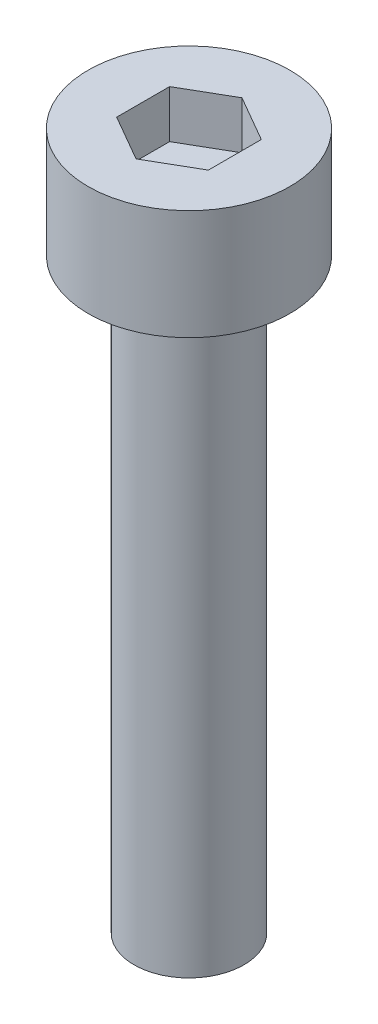
ISO-10303-21;
HEADER;
FILE_DESCRIPTION(('STEP AP214'),'2;1');
FILE_NAME('part.step','',(''),(''),'','','');
FILE_SCHEMA(('AUTOMOTIVE_DESIGN { 1 0 10303 214 1 1 1 1 }'));
ENDSEC;
DATA;
#1=APPLICATION_CONTEXT('core data for automotive mechanical design processes');
#2=APPLICATION_PROTOCOL_DEFINITION('international standard','automotive_design',2000,#1);
#3=PRODUCT_CONTEXT('',#1,'mechanical');
#4=PRODUCT('Part','Part','',(#3));
#5=PRODUCT_RELATED_PRODUCT_CATEGORY('part','',(#4));
#6=PRODUCT_DEFINITION_FORMATION('','',#4);
#7=PRODUCT_DEFINITION_CONTEXT('part definition',#1,'design');
#8=PRODUCT_DEFINITION('design','',#6,#7);
#9=PRODUCT_DEFINITION_SHAPE('','',#8);
#10=(LENGTH_UNIT() NAMED_UNIT(*) SI_UNIT(.MILLI.,.METRE.));
#11=(NAMED_UNIT(*) PLANE_ANGLE_UNIT() SI_UNIT($,.RADIAN.));
#12=(NAMED_UNIT(*) SI_UNIT($,.STERADIAN.) SOLID_ANGLE_UNIT());
#13=UNCERTAINTY_MEASURE_WITH_UNIT(LENGTH_MEASURE(1.E-05),#10,'distance_accuracy_value','');
#14=(GEOMETRIC_REPRESENTATION_CONTEXT(3) GLOBAL_UNCERTAINTY_ASSIGNED_CONTEXT((#13)) GLOBAL_UNIT_ASSIGNED_CONTEXT((#10,
#11,#12)) REPRESENTATION_CONTEXT('',''));
#15=CARTESIAN_POINT('',(0.,0.,0.));
#16=DIRECTION('',(0.,0.,1.));
#17=DIRECTION('',(1.,0.,0.));
#18=AXIS2_PLACEMENT_3D('',#15,#16,#17);
#19=CARTESIAN_POINT('',(0.,3.,0.));
#20=DIRECTION('',(0.,-1.,0.));
#21=DIRECTION('',(0.,0.,-1.));
#22=AXIS2_PLACEMENT_3D('',#19,#20,#21);
#23=CYLINDRICAL_SURFACE('',#22,2.75);
#24=CARTESIAN_POINT('',(0.,3.,0.));
#25=DIRECTION('',(0.,1.,0.));
#26=DIRECTION('',(0.,0.,1.));
#27=AXIS2_PLACEMENT_3D('',#24,#25,#26);
#28=CIRCLE('',#27,2.75);
#29=CARTESIAN_POINT('',(0.,3.,2.75));
#30=VERTEX_POINT('',#29);
#31=EDGE_CURVE('E48',#30,#30,#28,.T.);
#32=ORIENTED_EDGE('',*,*,#31,.F.);
#33=EDGE_LOOP('',(#32));
#34=FACE_BOUND('',#33,.T.);
#35=CARTESIAN_POINT('',(0.,0.,0.));
#36=DIRECTION('',(0.,1.,0.));
#37=DIRECTION('',(0.,0.,1.));
#38=AXIS2_PLACEMENT_3D('',#35,#36,#37);
#39=CIRCLE('',#38,2.75);
#40=CARTESIAN_POINT('',(0.,0.,2.75));
#41=VERTEX_POINT('',#40);
#42=EDGE_CURVE('E42',#41,#41,#39,.T.);
#43=ORIENTED_EDGE('',*,*,#42,.T.);
#44=EDGE_LOOP('',(#43));
#45=FACE_BOUND('',#44,.T.);
#46=ADVANCED_FACE('F39',(#34,#45),#23,.T.);
#47=CARTESIAN_POINT('',(0.,3.,0.));
#48=DIRECTION('',(0.,1.,0.));
#49=DIRECTION('',(0.,0.,1.));
#50=AXIS2_PLACEMENT_3D('',#47,#48,#49);
#51=PLANE('',#50);
#52=DIRECTION('',(-0.866025403784439,0.,-0.5));
#53=VECTOR('',#52,1.);
#54=CARTESIAN_POINT('',(1.25,3.,-0.721687836487033));
#55=LINE('',#54,#53);
#56=CARTESIAN_POINT('',(1.25,3.,-0.721687836487033));
#57=VERTEX_POINT('',#56);
#58=CARTESIAN_POINT('',(0.,3.,-1.44337567297407));
#59=VERTEX_POINT('',#58);
#60=EDGE_CURVE('E56',#57,#59,#55,.T.);
#61=ORIENTED_EDGE('',*,*,#60,.F.);
#62=DIRECTION('',(0.,0.,-1.));
#63=VECTOR('',#62,1.);
#64=CARTESIAN_POINT('',(1.25,3.,0.721687836487033));
#65=LINE('',#64,#63);
#66=CARTESIAN_POINT('',(1.25,3.,0.721687836487033));
#67=VERTEX_POINT('',#66);
#68=EDGE_CURVE('E150',#67,#57,#65,.T.);
#69=ORIENTED_EDGE('',*,*,#68,.F.);
#70=DIRECTION('',(0.866025403784439,0.,-0.5));
#71=VECTOR('',#70,1.);
#72=CARTESIAN_POINT('',(0.,3.,1.44337567297406));
#73=LINE('',#72,#71);
#74=CARTESIAN_POINT('',(0.,3.,1.44337567297406));
#75=VERTEX_POINT('',#74);
#76=EDGE_CURVE('E147',#75,#67,#73,.T.);
#77=ORIENTED_EDGE('',*,*,#76,.F.);
#78=DIRECTION('',(0.866025403784439,0.,0.5));
#79=VECTOR('',#78,1.);
#80=CARTESIAN_POINT('',(-1.25,3.,0.721687836487032));
#81=LINE('',#80,#79);
#82=CARTESIAN_POINT('',(-1.25,3.,0.721687836487032));
#83=VERTEX_POINT('',#82);
#84=EDGE_CURVE('E104',#83,#75,#81,.T.);
#85=ORIENTED_EDGE('',*,*,#84,.F.);
#86=DIRECTION('',(0.,0.,1.));
#87=VECTOR('',#86,1.);
#88=CARTESIAN_POINT('',(-1.25,3.,-0.721687836487033));
#89=LINE('',#88,#87);
#90=CARTESIAN_POINT('',(-1.25,3.,-0.721687836487033));
#91=VERTEX_POINT('',#90);
#92=EDGE_CURVE('E141',#91,#83,#89,.T.);
#93=ORIENTED_EDGE('',*,*,#92,.F.);
#94=DIRECTION('',(-0.866025403784439,0.,0.5));
#95=VECTOR('',#94,1.);
#96=CARTESIAN_POINT('',(0.,3.,-1.44337567297407));
#97=LINE('',#96,#95);
#98=EDGE_CURVE('E136',#59,#91,#97,.T.);
#99=ORIENTED_EDGE('',*,*,#98,.F.);
#100=EDGE_LOOP('',(#61,#69,#77,#85,#93,#99));
#101=FACE_BOUND('',#100,.T.);
#102=ORIENTED_EDGE('',*,*,#31,.T.);
#103=EDGE_LOOP('',(#102));
#104=FACE_BOUND('',#103,.T.);
#105=ADVANCED_FACE('F176',(#101,#104),#51,.T.);
#106=CARTESIAN_POINT('',(0.,0.,0.));
#107=DIRECTION('',(0.,1.,0.));
#108=DIRECTION('',(0.,0.,1.));
#109=AXIS2_PLACEMENT_3D('',#106,#107,#108);
#110=PLANE('',#109);
#111=CARTESIAN_POINT('',(0.,0.,0.));
#112=DIRECTION('',(0.,-1.,0.));
#113=DIRECTION('',(0.,0.,-1.));
#114=AXIS2_PLACEMENT_3D('',#111,#112,#113);
#115=CIRCLE('',#114,1.5);
#116=CARTESIAN_POINT('',(0.,0.,-1.5));
#117=VERTEX_POINT('',#116);
#118=EDGE_CURVE('E11',#117,#117,#115,.T.);
#119=ORIENTED_EDGE('',*,*,#118,.F.);
#120=EDGE_LOOP('',(#119));
#121=FACE_BOUND('',#120,.T.);
#122=ORIENTED_EDGE('',*,*,#42,.F.);
#123=EDGE_LOOP('',(#122));
#124=FACE_BOUND('',#123,.T.);
#125=ADVANCED_FACE('F173',(#121,#124),#110,.F.);
#126=CARTESIAN_POINT('',(1.25,1.7,-0.721687836487033));
#127=DIRECTION('',(0.5,0.,-0.866025403784439));
#128=DIRECTION('',(-0.866025403784439,0.,-0.5));
#129=AXIS2_PLACEMENT_3D('',#126,#127,#128);
#130=PLANE('',#129);
#131=ORIENTED_EDGE('',*,*,#60,.T.);
#132=DIRECTION('',(0.,1.,0.));
#133=VECTOR('',#132,1.);
#134=CARTESIAN_POINT('',(0.,1.7,-1.44337567297407));
#135=LINE('',#134,#133);
#136=CARTESIAN_POINT('',(0.,1.7,-1.44337567297407));
#137=VERTEX_POINT('',#136);
#138=EDGE_CURVE('E86',#137,#59,#135,.T.);
#139=ORIENTED_EDGE('',*,*,#138,.F.);
#140=DIRECTION('',(-0.866025403784439,0.,-0.5));
#141=VECTOR('',#140,1.);
#142=CARTESIAN_POINT('',(1.25,1.7,-0.721687836487033));
#143=LINE('',#142,#141);
#144=CARTESIAN_POINT('',(1.25,1.7,-0.721687836487033));
#145=VERTEX_POINT('',#144);
#146=EDGE_CURVE('E153',#145,#137,#143,.T.);
#147=ORIENTED_EDGE('',*,*,#146,.F.);
#148=DIRECTION('',(0.,1.,0.));
#149=VECTOR('',#148,1.);
#150=CARTESIAN_POINT('',(1.25,1.7,-0.721687836487033));
#151=LINE('',#150,#149);
#152=EDGE_CURVE('E64',#145,#57,#151,.T.);
#153=ORIENTED_EDGE('',*,*,#152,.T.);
#154=EDGE_LOOP('',(#131,#139,#147,#153));
#155=FACE_BOUND('',#154,.T.);
#156=ADVANCED_FACE('F175',(#155),#130,.F.);
#157=CARTESIAN_POINT('',(1.25,1.7,0.721687836487033));
#158=DIRECTION('',(1.,0.,0.));
#159=DIRECTION('',(0.,0.,-1.));
#160=AXIS2_PLACEMENT_3D('',#157,#158,#159);
#161=PLANE('',#160);
#162=ORIENTED_EDGE('',*,*,#68,.T.);
#163=ORIENTED_EDGE('',*,*,#152,.F.);
#164=DIRECTION('',(0.,0.,-1.));
#165=VECTOR('',#164,1.);
#166=CARTESIAN_POINT('',(1.25,1.7,0.721687836487033));
#167=LINE('',#166,#165);
#168=CARTESIAN_POINT('',(1.25,1.7,0.721687836487033));
#169=VERTEX_POINT('',#168);
#170=EDGE_CURVE('E118',#169,#145,#167,.T.);
#171=ORIENTED_EDGE('',*,*,#170,.F.);
#172=DIRECTION('',(0.,1.,0.));
#173=VECTOR('',#172,1.);
#174=CARTESIAN_POINT('',(1.25,1.7,0.721687836487033));
#175=LINE('',#174,#173);
#176=EDGE_CURVE('E109',#169,#67,#175,.T.);
#177=ORIENTED_EDGE('',*,*,#176,.T.);
#178=EDGE_LOOP('',(#162,#163,#171,#177));
#179=FACE_BOUND('',#178,.T.);
#180=ADVANCED_FACE('F182',(#179),#161,.F.);
#181=CARTESIAN_POINT('',(0.,1.7,1.44337567297406));
#182=DIRECTION('',(0.5,0.,0.866025403784439));
#183=DIRECTION('',(0.866025403784439,0.,-0.5));
#184=AXIS2_PLACEMENT_3D('',#181,#182,#183);
#185=PLANE('',#184);
#186=ORIENTED_EDGE('',*,*,#76,.T.);
#187=ORIENTED_EDGE('',*,*,#176,.F.);
#188=DIRECTION('',(0.866025403784439,0.,-0.5));
#189=VECTOR('',#188,1.);
#190=CARTESIAN_POINT('',(0.,1.7,1.44337567297406));
#191=LINE('',#190,#189);
#192=CARTESIAN_POINT('',(0.,1.7,1.44337567297406));
#193=VERTEX_POINT('',#192);
#194=EDGE_CURVE('E113',#193,#169,#191,.T.);
#195=ORIENTED_EDGE('',*,*,#194,.F.);
#196=DIRECTION('',(0.,1.,0.));
#197=VECTOR('',#196,1.);
#198=CARTESIAN_POINT('',(0.,1.7,1.44337567297406));
#199=LINE('',#198,#197);
#200=EDGE_CURVE('E97',#193,#75,#199,.T.);
#201=ORIENTED_EDGE('',*,*,#200,.T.);
#202=EDGE_LOOP('',(#186,#187,#195,#201));
#203=FACE_BOUND('',#202,.T.);
#204=ADVANCED_FACE('F114',(#203),#185,.F.);
#205=CARTESIAN_POINT('',(-1.25,1.7,0.721687836487032));
#206=DIRECTION('',(-0.5,0.,0.866025403784439));
#207=DIRECTION('',(0.866025403784439,0.,0.5));
#208=AXIS2_PLACEMENT_3D('',#205,#206,#207);
#209=PLANE('',#208);
#210=ORIENTED_EDGE('',*,*,#84,.T.);
#211=ORIENTED_EDGE('',*,*,#200,.F.);
#212=DIRECTION('',(0.866025403784439,0.,0.5));
#213=VECTOR('',#212,1.);
#214=CARTESIAN_POINT('',(-1.25,1.7,0.721687836487032));
#215=LINE('',#214,#213);
#216=CARTESIAN_POINT('',(-1.25,1.7,0.721687836487032));
#217=VERTEX_POINT('',#216);
#218=EDGE_CURVE('E101',#217,#193,#215,.T.);
#219=ORIENTED_EDGE('',*,*,#218,.F.);
#220=DIRECTION('',(0.,1.,0.));
#221=VECTOR('',#220,1.);
#222=CARTESIAN_POINT('',(-1.25,1.7,0.721687836487032));
#223=LINE('',#222,#221);
#224=EDGE_CURVE('E110',#217,#83,#223,.T.);
#225=ORIENTED_EDGE('',*,*,#224,.T.);
#226=EDGE_LOOP('',(#210,#211,#219,#225));
#227=FACE_BOUND('',#226,.T.);
#228=ADVANCED_FACE('F99',(#227),#209,.F.);
#229=CARTESIAN_POINT('',(-1.25,1.7,-0.721687836487033));
#230=DIRECTION('',(-1.,0.,0.));
#231=DIRECTION('',(0.,0.,1.));
#232=AXIS2_PLACEMENT_3D('',#229,#230,#231);
#233=PLANE('',#232);
#234=ORIENTED_EDGE('',*,*,#92,.T.);
#235=ORIENTED_EDGE('',*,*,#224,.F.);
#236=DIRECTION('',(0.,0.,1.));
#237=VECTOR('',#236,1.);
#238=CARTESIAN_POINT('',(-1.25,1.7,-0.721687836487033));
#239=LINE('',#238,#237);
#240=CARTESIAN_POINT('',(-1.25,1.7,-0.721687836487033));
#241=VERTEX_POINT('',#240);
#242=EDGE_CURVE('E124',#241,#217,#239,.T.);
#243=ORIENTED_EDGE('',*,*,#242,.F.);
#244=DIRECTION('',(0.,1.,0.));
#245=VECTOR('',#244,1.);
#246=CARTESIAN_POINT('',(-1.25,1.7,-0.721687836487033));
#247=LINE('',#246,#245);
#248=EDGE_CURVE('E160',#241,#91,#247,.T.);
#249=ORIENTED_EDGE('',*,*,#248,.T.);
#250=EDGE_LOOP('',(#234,#235,#243,#249));
#251=FACE_BOUND('',#250,.T.);
#252=ADVANCED_FACE('F227',(#251),#233,.F.);
#253=CARTESIAN_POINT('',(0.,1.7,-1.44337567297407));
#254=DIRECTION('',(-0.5,0.,-0.866025403784439));
#255=DIRECTION('',(-0.866025403784439,0.,0.5));
#256=AXIS2_PLACEMENT_3D('',#253,#254,#255);
#257=PLANE('',#256);
#258=ORIENTED_EDGE('',*,*,#98,.T.);
#259=ORIENTED_EDGE('',*,*,#248,.F.);
#260=DIRECTION('',(-0.866025403784439,0.,0.5));
#261=VECTOR('',#260,1.);
#262=CARTESIAN_POINT('',(0.,1.7,-1.44337567297407));
#263=LINE('',#262,#261);
#264=EDGE_CURVE('E128',#137,#241,#263,.T.);
#265=ORIENTED_EDGE('',*,*,#264,.F.);
#266=ORIENTED_EDGE('',*,*,#138,.T.);
#267=EDGE_LOOP('',(#258,#259,#265,#266));
#268=FACE_BOUND('',#267,.T.);
#269=ADVANCED_FACE('F236',(#268),#257,.F.);
#270=CARTESIAN_POINT('',(0.,1.7,0.));
#271=DIRECTION('',(0.,1.,0.));
#272=DIRECTION('',(0.,0.,1.));
#273=AXIS2_PLACEMENT_3D('',#270,#271,#272);
#274=PLANE('',#273);
#275=ORIENTED_EDGE('',*,*,#146,.T.);
#276=ORIENTED_EDGE('',*,*,#264,.T.);
#277=ORIENTED_EDGE('',*,*,#242,.T.);
#278=ORIENTED_EDGE('',*,*,#218,.T.);
#279=ORIENTED_EDGE('',*,*,#194,.T.);
#280=ORIENTED_EDGE('',*,*,#170,.T.);
#281=EDGE_LOOP('',(#275,#276,#277,#278,#279,#280));
#282=FACE_BOUND('',#281,.T.);
#283=ADVANCED_FACE('F121',(#282),#274,.T.);
#284=CARTESIAN_POINT('',(0.,-16.,0.));
#285=DIRECTION('',(0.,1.,0.));
#286=DIRECTION('',(0.,0.,1.));
#287=AXIS2_PLACEMENT_3D('',#284,#285,#286);
#288=CYLINDRICAL_SURFACE('',#287,1.5);
#289=CARTESIAN_POINT('',(0.,-16.,0.));
#290=DIRECTION('',(0.,-1.,0.));
#291=DIRECTION('',(0.,0.,-1.));
#292=AXIS2_PLACEMENT_3D('',#289,#290,#291);
#293=CIRCLE('',#292,1.5);
#294=CARTESIAN_POINT('',(0.,-16.,-1.5));
#295=VERTEX_POINT('',#294);
#296=EDGE_CURVE('E137',#295,#295,#293,.T.);
#297=ORIENTED_EDGE('',*,*,#296,.F.);
#298=EDGE_LOOP('',(#297));
#299=FACE_BOUND('',#298,.T.);
#300=ORIENTED_EDGE('',*,*,#118,.T.);
#301=EDGE_LOOP('',(#300));
#302=FACE_BOUND('',#301,.T.);
#303=ADVANCED_FACE('F254',(#299,#302),#288,.T.);
#304=CARTESIAN_POINT('',(0.,-16.,0.));
#305=DIRECTION('',(0.,-1.,0.));
#306=DIRECTION('',(0.,0.,-1.));
#307=AXIS2_PLACEMENT_3D('',#304,#305,#306);
#308=PLANE('',#307);
#309=ORIENTED_EDGE('',*,*,#296,.T.);
#310=EDGE_LOOP('',(#309));
#311=FACE_BOUND('',#310,.T.);
#312=ADVANCED_FACE('F267',(#311),#308,.T.);
#313=CLOSED_SHELL('',(#46,#105,#125,#156,#180,#204,#228,#252,#269,#283,#303,#312));
#314=MANIFOLD_SOLID_BREP('B2',#313);
#315=ADVANCED_BREP_SHAPE_REPRESENTATION('',(#18,#314),#14);
#316=SHAPE_DEFINITION_REPRESENTATION(#9,#315);
ENDSEC;
END-ISO-10303-21;
